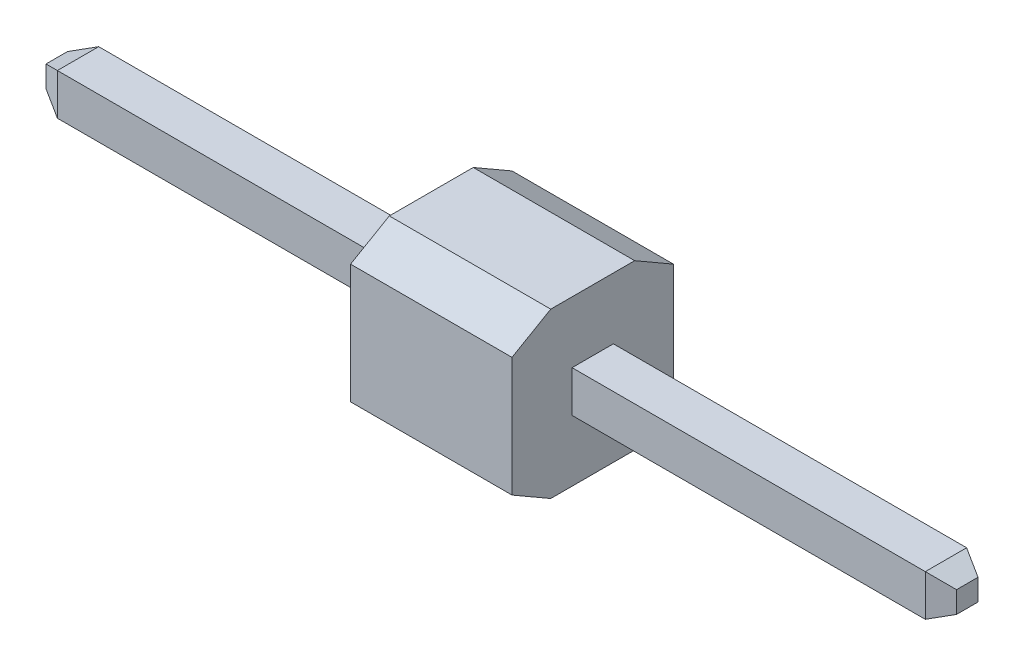
ISO-10303-21;
HEADER;
FILE_DESCRIPTION(('STEP AP214'),'2;1');
FILE_NAME('part.step','',(''),(''),'','','');
FILE_SCHEMA(('AUTOMOTIVE_DESIGN { 1 0 10303 214 1 1 1 1 }'));
ENDSEC;
DATA;
#1=APPLICATION_CONTEXT('core data for automotive mechanical design processes');
#2=APPLICATION_PROTOCOL_DEFINITION('international standard','automotive_design',2000,#1);
#3=PRODUCT_CONTEXT('',#1,'mechanical');
#4=PRODUCT('Part','Part','',(#3));
#5=PRODUCT_RELATED_PRODUCT_CATEGORY('part','',(#4));
#6=PRODUCT_DEFINITION_FORMATION('','',#4);
#7=PRODUCT_DEFINITION_CONTEXT('part definition',#1,'design');
#8=PRODUCT_DEFINITION('design','',#6,#7);
#9=PRODUCT_DEFINITION_SHAPE('','',#8);
#10=(LENGTH_UNIT() NAMED_UNIT(*) SI_UNIT(.MILLI.,.METRE.));
#11=(NAMED_UNIT(*) PLANE_ANGLE_UNIT() SI_UNIT($,.RADIAN.));
#12=(NAMED_UNIT(*) SI_UNIT($,.STERADIAN.) SOLID_ANGLE_UNIT());
#13=UNCERTAINTY_MEASURE_WITH_UNIT(LENGTH_MEASURE(1.E-05),#10,'distance_accuracy_value','');
#14=(GEOMETRIC_REPRESENTATION_CONTEXT(3) GLOBAL_UNCERTAINTY_ASSIGNED_CONTEXT((#13)) GLOBAL_UNIT_ASSIGNED_CONTEXT((#10,
#11,#12)) REPRESENTATION_CONTEXT('',''));
#15=CARTESIAN_POINT('',(0.,0.,0.));
#16=DIRECTION('',(0.,0.,1.));
#17=DIRECTION('',(1.,0.,0.));
#18=AXIS2_PLACEMENT_3D('',#15,#16,#17);
#19=CARTESIAN_POINT('',(5.42105003898686,2.22287173708609,0.629998634255617));
#20=DIRECTION('',(1.,4.37113882867379E-08,-4.37113882867379E-08));
#21=DIRECTION('',(-4.37113882867379E-08,1.,0.));
#22=AXIS2_PLACEMENT_3D('',#19,#20,#21);
#23=PLANE('',#22);
#24=DIRECTION('',(1.59994790123753E-08,0.500000000000193,0.866025403784327));
#25=VECTOR('',#24,1.);
#26=CARTESIAN_POINT('',(5.42104991600094,3.46646157557208,-0.940001365744382));
#27=LINE('',#26,#25);
#28=CARTESIAN_POINT('',(5.42104991600094,3.46646157557208,-0.940001365744382));
#29=VERTEX_POINT('',#28);
#30=CARTESIAN_POINT('',(5.4210499270857,3.81287173708609,-0.340001365744383));
#31=VERTEX_POINT('',#30);
#32=EDGE_CURVE('E11',#29,#31,#27,.T.);
#33=ORIENTED_EDGE('',*,*,#32,.T.);
#34=DIRECTION('',(4.37113880134522E-08,0.,0.999999999999999));
#35=VECTOR('',#34,1.);
#36=CARTESIAN_POINT('',(5.4210499270857,3.81287173708609,-0.340001365744383));
#37=LINE('',#36,#35);
#38=CARTESIAN_POINT('',(5.42104998391051,3.81287173708609,0.959998634255618));
#39=VERTEX_POINT('',#38);
#40=EDGE_CURVE('E304',#31,#39,#37,.T.);
#41=ORIENTED_EDGE('',*,*,#40,.T.);
#42=DIRECTION('',(5.97108668824037E-08,-0.500000000000186,0.866025403784329));
#43=VECTOR('',#42,1.);
#44=CARTESIAN_POINT('',(5.42104998391051,3.81287173708609,0.959998634255618));
#45=LINE('',#44,#43);
#46=CARTESIAN_POINT('',(5.42105002527941,3.46646157557209,1.55999863425562));
#47=VERTEX_POINT('',#46);
#48=EDGE_CURVE('E296',#39,#47,#45,.T.);
#49=ORIENTED_EDGE('',*,*,#48,.T.);
#50=DIRECTION('',(4.37113884816491E-08,-0.999999999999999,0.));
#51=VECTOR('',#50,1.);
#52=CARTESIAN_POINT('',(5.42105002527941,3.46646157557209,1.55999863425562));
#53=LINE('',#52,#51);
#54=CARTESIAN_POINT('',(5.4210501060222,1.61928189860609,1.55999863425562));
#55=VERTEX_POINT('',#54);
#56=EDGE_CURVE('E281',#47,#55,#53,.T.);
#57=ORIENTED_EDGE('',*,*,#56,.T.);
#58=DIRECTION('',(1.5999479012306E-08,0.500000000000192,0.866025403784328));
#59=VECTOR('',#58,1.);
#60=CARTESIAN_POINT('',(5.42105009493743,1.27287173708609,0.959998634255618));
#61=LINE('',#60,#59);
#62=CARTESIAN_POINT('',(5.42105009493743,1.27287173708609,0.959998634255618));
#63=VERTEX_POINT('',#62);
#64=EDGE_CURVE('E265',#63,#55,#61,.T.);
#65=ORIENTED_EDGE('',*,*,#64,.F.);
#66=DIRECTION('',(4.37113886966664E-08,0.,0.999999999999999));
#67=VECTOR('',#66,1.);
#68=CARTESIAN_POINT('',(5.42105003811263,1.27287173708609,-0.340001365744383));
#69=LINE('',#68,#67);
#70=CARTESIAN_POINT('',(5.42105003811263,1.27287173708609,-0.340001365744383));
#71=VERTEX_POINT('',#70);
#72=EDGE_CURVE('E248',#71,#63,#69,.T.);
#73=ORIENTED_EDGE('',*,*,#72,.F.);
#74=DIRECTION('',(5.971086560017E-08,-0.500000000000187,0.866025403784329));
#75=VECTOR('',#74,1.);
#76=CARTESIAN_POINT('',(5.42104999674373,1.61928189860608,-0.940001365744382));
#77=LINE('',#76,#75);
#78=CARTESIAN_POINT('',(5.42104999674373,1.61928189860608,-0.940001365744382));
#79=VERTEX_POINT('',#78);
#80=EDGE_CURVE('E242',#79,#71,#77,.T.);
#81=ORIENTED_EDGE('',*,*,#80,.F.);
#82=DIRECTION('',(4.37113884816491E-08,-0.999999999999999,0.));
#83=VECTOR('',#82,1.);
#84=CARTESIAN_POINT('',(5.42104991600094,3.46646157557208,-0.940001365744382));
#85=LINE('',#84,#83);
#86=EDGE_CURVE('E236',#29,#79,#85,.T.);
#87=ORIENTED_EDGE('',*,*,#86,.F.);
#88=EDGE_LOOP('',(#33,#41,#49,#57,#65,#73,#81,#87));
#89=FACE_BOUND('',#88,.T.);
#90=DIRECTION('',(-4.37113886753159E-08,0.,-0.999999999999999));
#91=VECTOR('',#90,1.);
#92=CARTESIAN_POINT('',(5.42105001101157,2.86287173708609,0.629998634255617));
#93=LINE('',#92,#91);
#94=CARTESIAN_POINT('',(5.42105001101157,2.86287173708609,0.629998634255617));
#95=VERTEX_POINT('',#94);
#96=CARTESIAN_POINT('',(5.42104998303628,2.86287173708609,-0.0100013657443826));
#97=VERTEX_POINT('',#96);
#98=EDGE_CURVE('E302',#95,#97,#93,.T.);
#99=ORIENTED_EDGE('',*,*,#98,.T.);
#100=DIRECTION('',(-4.37113886753159E-08,0.999999999999999,0.));
#101=VECTOR('',#100,1.);
#102=CARTESIAN_POINT('',(5.42105001101157,2.22287173708609,-0.0100013657443826));
#103=LINE('',#102,#101);
#104=CARTESIAN_POINT('',(5.42105001101157,2.22287173708609,-0.0100013657443826));
#105=VERTEX_POINT('',#104);
#106=EDGE_CURVE('E293',#105,#97,#103,.T.);
#107=ORIENTED_EDGE('',*,*,#106,.F.);
#108=DIRECTION('',(-4.37113886753159E-08,0.,-0.999999999999999));
#109=VECTOR('',#108,1.);
#110=CARTESIAN_POINT('',(5.42105003898686,2.22287173708609,0.629998634255617));
#111=LINE('',#110,#109);
#112=CARTESIAN_POINT('',(5.42105003898686,2.22287173708609,0.629998634255617));
#113=VERTEX_POINT('',#112);
#114=EDGE_CURVE('E278',#113,#105,#111,.T.);
#115=ORIENTED_EDGE('',*,*,#114,.F.);
#116=DIRECTION('',(-4.37113886753159E-08,0.999999999999999,0.));
#117=VECTOR('',#116,1.);
#118=CARTESIAN_POINT('',(5.42105003898686,2.22287173708609,0.629998634255617));
#119=LINE('',#118,#117);
#120=EDGE_CURVE('E263',#113,#95,#119,.T.);
#121=ORIENTED_EDGE('',*,*,#120,.T.);
#122=EDGE_LOOP('',(#99,#107,#115,#121));
#123=FACE_BOUND('',#122,.T.);
#124=ADVANCED_FACE('F17',(#89,#123),#23,.T.);
#125=CARTESIAN_POINT('',(2.92105003898686,2.22287162780762,0.629998743534088));
#126=DIRECTION('',(1.,4.37113882867379E-08,-4.37113882867379E-08));
#127=DIRECTION('',(-4.37113882867379E-08,1.,0.));
#128=AXIS2_PLACEMENT_3D('',#125,#126,#127);
#129=PLANE('',#128);
#130=DIRECTION('',(1.59994790123753E-08,0.500000000000193,0.866025403784327));
#131=VECTOR('',#130,1.);
#132=CARTESIAN_POINT('',(2.92104991600094,3.46646146629361,-0.940001256465912));
#133=LINE('',#132,#131);
#134=CARTESIAN_POINT('',(2.92104991600094,3.46646146629361,-0.940001256465912));
#135=VERTEX_POINT('',#134);
#136=CARTESIAN_POINT('',(2.9210499270857,3.81287162780762,-0.340001256465912));
#137=VERTEX_POINT('',#136);
#138=EDGE_CURVE('E24',#135,#137,#133,.T.);
#139=ORIENTED_EDGE('',*,*,#138,.F.);
#140=DIRECTION('',(4.37113884816491E-08,-0.999999999999999,0.));
#141=VECTOR('',#140,1.);
#142=CARTESIAN_POINT('',(2.92104991600094,3.46646146629361,-0.940001256465912));
#143=LINE('',#142,#141);
#144=CARTESIAN_POINT('',(2.92104999674373,1.61928178932761,-0.940001256465912));
#145=VERTEX_POINT('',#144);
#146=EDGE_CURVE('E300',#135,#145,#143,.T.);
#147=ORIENTED_EDGE('',*,*,#146,.T.);
#148=DIRECTION('',(5.97108662411576E-08,-0.500000000000187,0.866025403784329));
#149=VECTOR('',#148,1.);
#150=CARTESIAN_POINT('',(2.92104999674373,1.61928178932761,-0.940001256465912));
#151=LINE('',#150,#149);
#152=CARTESIAN_POINT('',(2.92105003811263,1.27287162780762,-0.340001256465912));
#153=VERTEX_POINT('',#152);
#154=EDGE_CURVE('E286',#145,#153,#151,.T.);
#155=ORIENTED_EDGE('',*,*,#154,.T.);
#156=DIRECTION('',(4.37113883550593E-08,0.,0.999999999999999));
#157=VECTOR('',#156,1.);
#158=CARTESIAN_POINT('',(2.92105003811263,1.27287162780762,-0.340001256465912));
#159=LINE('',#158,#157);
#160=CARTESIAN_POINT('',(2.92105009493743,1.27287162780762,0.959998743534088));
#161=VERTEX_POINT('',#160);
#162=EDGE_CURVE('E271',#153,#161,#159,.T.);
#163=ORIENTED_EDGE('',*,*,#162,.T.);
#164=DIRECTION('',(1.5999479012306E-08,0.500000000000192,0.866025403784328));
#165=VECTOR('',#164,1.);
#166=CARTESIAN_POINT('',(2.92105009493743,1.27287162780762,0.959998743534088));
#167=LINE('',#166,#165);
#168=CARTESIAN_POINT('',(2.9210501060222,1.61928178932762,1.55999874353409));
#169=VERTEX_POINT('',#168);
#170=EDGE_CURVE('E253',#161,#169,#167,.T.);
#171=ORIENTED_EDGE('',*,*,#170,.T.);
#172=DIRECTION('',(4.37113884816491E-08,-0.999999999999999,0.));
#173=VECTOR('',#172,1.);
#174=CARTESIAN_POINT('',(2.92105002527941,3.46646146629362,1.55999874353409));
#175=LINE('',#174,#173);
#176=CARTESIAN_POINT('',(2.92105002527941,3.46646146629362,1.55999874353409));
#177=VERTEX_POINT('',#176);
#178=EDGE_CURVE('E261',#177,#169,#175,.T.);
#179=ORIENTED_EDGE('',*,*,#178,.F.);
#180=DIRECTION('',(5.97108668824037E-08,-0.500000000000186,0.866025403784329));
#181=VECTOR('',#180,1.);
#182=CARTESIAN_POINT('',(2.92104998391051,3.81287162780762,0.959998743534088));
#183=LINE('',#182,#181);
#184=CARTESIAN_POINT('',(2.92104998391051,3.81287162780762,0.959998743534088));
#185=VERTEX_POINT('',#184);
#186=EDGE_CURVE('E276',#185,#177,#183,.T.);
#187=ORIENTED_EDGE('',*,*,#186,.F.);
#188=DIRECTION('',(4.37113880134522E-08,0.,0.999999999999999));
#189=VECTOR('',#188,1.);
#190=CARTESIAN_POINT('',(2.9210499270857,3.81287162780762,-0.340001256465912));
#191=LINE('',#190,#189);
#192=EDGE_CURVE('E291',#137,#185,#191,.T.);
#193=ORIENTED_EDGE('',*,*,#192,.F.);
#194=EDGE_LOOP('',(#139,#147,#155,#163,#171,#179,#187,#193));
#195=FACE_BOUND('',#194,.T.);
#196=DIRECTION('',(-4.37113886753159E-08,0.999999999999999,0.));
#197=VECTOR('',#196,1.);
#198=CARTESIAN_POINT('',(2.92105001101157,2.22287162780762,-0.0100012564659119));
#199=LINE('',#198,#197);
#200=CARTESIAN_POINT('',(2.92105001101157,2.22287162780762,-0.0100012564659119));
#201=VERTEX_POINT('',#200);
#202=CARTESIAN_POINT('',(2.92104998303628,2.86287162780762,-0.0100012564659119));
#203=VERTEX_POINT('',#202);
#204=EDGE_CURVE('E298',#201,#203,#199,.T.);
#205=ORIENTED_EDGE('',*,*,#204,.T.);
#206=DIRECTION('',(-4.37113886753159E-08,0.,-0.999999999999999));
#207=VECTOR('',#206,1.);
#208=CARTESIAN_POINT('',(2.92105001101157,2.86287162780762,0.629998743534088));
#209=LINE('',#208,#207);
#210=CARTESIAN_POINT('',(2.92105001101157,2.86287162780762,0.629998743534088));
#211=VERTEX_POINT('',#210);
#212=EDGE_CURVE('E283',#211,#203,#209,.T.);
#213=ORIENTED_EDGE('',*,*,#212,.F.);
#214=DIRECTION('',(-4.37113879814265E-08,0.999999999999999,0.));
#215=VECTOR('',#214,1.);
#216=CARTESIAN_POINT('',(2.92105003898686,2.22287162780762,0.629998743534088));
#217=LINE('',#216,#215);
#218=CARTESIAN_POINT('',(2.92105003898686,2.22287162780762,0.629998743534088));
#219=VERTEX_POINT('',#218);
#220=EDGE_CURVE('E268',#219,#211,#217,.T.);
#221=ORIENTED_EDGE('',*,*,#220,.F.);
#222=DIRECTION('',(-4.37113879814266E-08,0.,-0.999999999999999));
#223=VECTOR('',#222,1.);
#224=CARTESIAN_POINT('',(2.92105003898686,2.22287162780762,0.629998743534088));
#225=LINE('',#224,#223);
#226=EDGE_CURVE('E251',#219,#201,#225,.T.);
#227=ORIENTED_EDGE('',*,*,#226,.T.);
#228=EDGE_LOOP('',(#205,#213,#221,#227));
#229=FACE_BOUND('',#228,.T.);
#230=ADVANCED_FACE('F314',(#195,#229),#129,.F.);
#231=CARTESIAN_POINT('',(5.42104991600094,3.46646157557208,-0.940001365744382));
#232=DIRECTION('',(5.97108668343731E-08,-0.866025403784328,0.50000000000019));
#233=DIRECTION('',(-1.59994785476185E-08,-0.500000000000192,-0.866025403784329));
#234=AXIS2_PLACEMENT_3D('',#231,#232,#233);
#235=PLANE('',#234);
#236=ORIENTED_EDGE('',*,*,#138,.T.);
#237=DIRECTION('',(-0.999999999999998,-4.37113882867378E-08,4.37113883755557E-08));
#238=VECTOR('',#237,1.);
#239=CARTESIAN_POINT('',(5.4210499270857,3.81287173708609,-0.340001365744383));
#240=LINE('',#239,#238);
#241=EDGE_CURVE('E288',#31,#137,#240,.T.);
#242=ORIENTED_EDGE('',*,*,#241,.F.);
#243=ORIENTED_EDGE('',*,*,#32,.F.);
#244=DIRECTION('',(-0.999999999999998,-4.37113889972806E-08,4.37113881091022E-08));
#245=VECTOR('',#244,1.);
#246=CARTESIAN_POINT('',(5.42104991600094,3.46646157557208,-0.940001365744382));
#247=LINE('',#246,#245);
#248=EDGE_CURVE('E256',#29,#135,#247,.T.);
#249=ORIENTED_EDGE('',*,*,#248,.T.);
#250=EDGE_LOOP('',(#236,#242,#243,#249));
#251=FACE_BOUND('',#250,.T.);
#252=ADVANCED_FACE('F306',(#251),#235,.F.);
#253=CARTESIAN_POINT('',(5.4210499270857,3.81287173708609,-0.340001365744383));
#254=DIRECTION('',(4.37113882867379E-08,-1.,0.));
#255=DIRECTION('',(1.,4.37113882867379E-08,-4.37113882867379E-08));
#256=AXIS2_PLACEMENT_3D('',#253,#254,#255);
#257=PLANE('',#256);
#258=ORIENTED_EDGE('',*,*,#192,.T.);
#259=DIRECTION('',(-0.999999999999998,-4.37113882867378E-08,4.37113882867378E-08));
#260=VECTOR('',#259,1.);
#261=CARTESIAN_POINT('',(5.42104998391051,3.81287173708609,0.959998634255618));
#262=LINE('',#261,#260);
#263=EDGE_CURVE('E273',#39,#185,#262,.T.);
#264=ORIENTED_EDGE('',*,*,#263,.F.);
#265=ORIENTED_EDGE('',*,*,#40,.F.);
#266=ORIENTED_EDGE('',*,*,#241,.T.);
#267=EDGE_LOOP('',(#258,#264,#265,#266));
#268=FACE_BOUND('',#267,.T.);
#269=ADVANCED_FACE('F311',(#268),#257,.F.);
#270=CARTESIAN_POINT('',(5.42104998391051,3.81287173708609,0.959998634255618));
#271=DIRECTION('',(1.59994785476185E-08,-0.86602540378433,-0.50000000000019));
#272=DIRECTION('',(-5.97108668343731E-08,0.500000000000188,-0.866025403784329));
#273=AXIS2_PLACEMENT_3D('',#270,#271,#272);
#274=PLANE('',#273);
#275=ORIENTED_EDGE('',*,*,#186,.T.);
#276=DIRECTION('',(-0.999999999999998,-4.37113889972806E-08,4.37113882867378E-08));
#277=VECTOR('',#276,1.);
#278=CARTESIAN_POINT('',(5.42105002527941,3.46646157557209,1.55999863425562));
#279=LINE('',#278,#277);
#280=EDGE_CURVE('E258',#47,#177,#279,.T.);
#281=ORIENTED_EDGE('',*,*,#280,.F.);
#282=ORIENTED_EDGE('',*,*,#48,.F.);
#283=ORIENTED_EDGE('',*,*,#263,.T.);
#284=EDGE_LOOP('',(#275,#281,#282,#283));
#285=FACE_BOUND('',#284,.T.);
#286=ADVANCED_FACE('F319',(#285),#274,.F.);
#287=CARTESIAN_POINT('',(5.42105002527941,3.46646157557209,1.55999863425562));
#288=DIRECTION('',(-4.37113882867379E-08,0.,-1.));
#289=DIRECTION('',(-1.,-4.37113882867379E-08,4.37113882867379E-08));
#290=AXIS2_PLACEMENT_3D('',#287,#288,#289);
#291=PLANE('',#290);
#292=ORIENTED_EDGE('',*,*,#178,.T.);
#293=DIRECTION('',(-0.999999999999998,-4.37113889972806E-08,4.37113882867378E-08));
#294=VECTOR('',#293,1.);
#295=CARTESIAN_POINT('',(5.4210501060222,1.61928189860609,1.55999863425562));
#296=LINE('',#295,#294);
#297=EDGE_CURVE('E245',#55,#169,#296,.T.);
#298=ORIENTED_EDGE('',*,*,#297,.F.);
#299=ORIENTED_EDGE('',*,*,#56,.F.);
#300=ORIENTED_EDGE('',*,*,#280,.T.);
#301=EDGE_LOOP('',(#292,#298,#299,#300));
#302=FACE_BOUND('',#301,.T.);
#303=ADVANCED_FACE('F326',(#302),#291,.F.);
#304=CARTESIAN_POINT('',(5.42105009493743,1.27287173708609,0.959998634255618));
#305=DIRECTION('',(5.97108668343731E-08,-0.866025403784328,0.50000000000019));
#306=DIRECTION('',(-1.59994785476185E-08,-0.500000000000192,-0.866025403784329));
#307=AXIS2_PLACEMENT_3D('',#304,#305,#306);
#308=PLANE('',#307);
#309=ORIENTED_EDGE('',*,*,#170,.F.);
#310=DIRECTION('',(-0.999999999999998,-4.37113882867378E-08,4.37113882867378E-08));
#311=VECTOR('',#310,1.);
#312=CARTESIAN_POINT('',(5.42105009493743,1.27287173708609,0.959998634255618));
#313=LINE('',#312,#311);
#314=EDGE_CURVE('E239',#63,#161,#313,.T.);
#315=ORIENTED_EDGE('',*,*,#314,.F.);
#316=ORIENTED_EDGE('',*,*,#64,.T.);
#317=ORIENTED_EDGE('',*,*,#297,.T.);
#318=EDGE_LOOP('',(#309,#315,#316,#317));
#319=FACE_BOUND('',#318,.T.);
#320=ADVANCED_FACE('F329',(#319),#308,.T.);
#321=CARTESIAN_POINT('',(5.42105003811263,1.27287173708609,-0.340001365744383));
#322=DIRECTION('',(4.37113882867379E-08,-1.,0.));
#323=DIRECTION('',(1.,4.37113882867379E-08,-4.37113882867379E-08));
#324=AXIS2_PLACEMENT_3D('',#321,#322,#323);
#325=PLANE('',#324);
#326=ORIENTED_EDGE('',*,*,#162,.F.);
#327=DIRECTION('',(-0.999999999999998,-4.37113882867378E-08,4.37113883755557E-08));
#328=VECTOR('',#327,1.);
#329=CARTESIAN_POINT('',(5.42105003811263,1.27287173708609,-0.340001365744383));
#330=LINE('',#329,#328);
#331=EDGE_CURVE('E233',#71,#153,#330,.T.);
#332=ORIENTED_EDGE('',*,*,#331,.F.);
#333=ORIENTED_EDGE('',*,*,#72,.T.);
#334=ORIENTED_EDGE('',*,*,#314,.T.);
#335=EDGE_LOOP('',(#326,#332,#333,#334));
#336=FACE_BOUND('',#335,.T.);
#337=ADVANCED_FACE('F333',(#336),#325,.T.);
#338=CARTESIAN_POINT('',(5.42104999674373,1.61928189860608,-0.940001365744382));
#339=DIRECTION('',(1.59994785476185E-08,-0.86602540378433,-0.50000000000019));
#340=DIRECTION('',(-5.97108668343731E-08,0.500000000000188,-0.866025403784329));
#341=AXIS2_PLACEMENT_3D('',#338,#339,#340);
#342=PLANE('',#341);
#343=ORIENTED_EDGE('',*,*,#154,.F.);
#344=DIRECTION('',(-0.999999999999998,-4.37113889972806E-08,4.37113881091022E-08));
#345=VECTOR('',#344,1.);
#346=CARTESIAN_POINT('',(5.42104999674373,1.61928189860608,-0.940001365744382));
#347=LINE('',#346,#345);
#348=EDGE_CURVE('E230',#79,#145,#347,.T.);
#349=ORIENTED_EDGE('',*,*,#348,.F.);
#350=ORIENTED_EDGE('',*,*,#80,.T.);
#351=ORIENTED_EDGE('',*,*,#331,.T.);
#352=EDGE_LOOP('',(#343,#349,#350,#351));
#353=FACE_BOUND('',#352,.T.);
#354=ADVANCED_FACE('F337',(#353),#342,.T.);
#355=CARTESIAN_POINT('',(5.42104991600094,3.46646157557208,-0.940001365744382));
#356=DIRECTION('',(-4.37113882867379E-08,0.,-1.));
#357=DIRECTION('',(-4.37113882867379E-08,1.,0.));
#358=AXIS2_PLACEMENT_3D('',#355,#356,#357);
#359=PLANE('',#358);
#360=ORIENTED_EDGE('',*,*,#146,.F.);
#361=ORIENTED_EDGE('',*,*,#248,.F.);
#362=ORIENTED_EDGE('',*,*,#86,.T.);
#363=ORIENTED_EDGE('',*,*,#348,.T.);
#364=EDGE_LOOP('',(#360,#361,#362,#363));
#365=FACE_BOUND('',#364,.T.);
#366=ADVANCED_FACE('F339',(#365),#359,.T.);
#367=CARTESIAN_POINT('',(-2.87894996101314,2.22287137428157,0.62999899706014));
#368=DIRECTION('',(-1.,-4.37113882867379E-08,4.37113882867379E-08));
#369=DIRECTION('',(4.37113882867379E-08,-1.,0.));
#370=AXIS2_PLACEMENT_3D('',#367,#368,#369);
#371=PLANE('',#370);
#372=DIRECTION('',(4.37113847292273E-08,-0.999999999999999,0.));
#373=VECTOR('',#372,1.);
#374=CARTESIAN_POINT('',(-2.87895000351097,2.70898984709056,0.14388052425114));
#375=LINE('',#374,#373);
#376=CARTESIAN_POINT('',(-2.87895000351097,2.70898984709056,0.14388052425114));
#377=VERTEX_POINT('',#376);
#378=CARTESIAN_POINT('',(-2.87894998898843,2.37675290148156,0.14388052425114));
#379=VERTEX_POINT('',#378);
#380=EDGE_CURVE('E228',#377,#379,#375,.T.);
#381=ORIENTED_EDGE('',*,*,#380,.T.);
#382=DIRECTION('',(4.37113874013716E-08,0.,0.999999999999999));
#383=VECTOR('',#382,1.);
#384=CARTESIAN_POINT('',(-2.87894998898843,2.37675290148156,0.14388052425114));
#385=LINE('',#384,#383);
#386=CARTESIAN_POINT('',(-2.8789499744659,2.37675290148156,0.47611746986914));
#387=VERTEX_POINT('',#386);
#388=EDGE_CURVE('E223',#379,#387,#385,.T.);
#389=ORIENTED_EDGE('',*,*,#388,.T.);
#390=DIRECTION('',(-4.37113900758839E-08,0.999999999999999,0.));
#391=VECTOR('',#390,1.);
#392=CARTESIAN_POINT('',(-2.87894997446589,2.37675290148156,0.47611746986914));
#393=LINE('',#392,#391);
#394=CARTESIAN_POINT('',(-2.87894998898843,2.70898984709057,0.47611746986914));
#395=VERTEX_POINT('',#394);
#396=EDGE_CURVE('E215',#387,#395,#393,.T.);
#397=ORIENTED_EDGE('',*,*,#396,.T.);
#398=DIRECTION('',(-4.37113820547151E-08,0.,-0.999999999999999));
#399=VECTOR('',#398,1.);
#400=CARTESIAN_POINT('',(-2.87894998898843,2.70898984709057,0.47611746986914));
#401=LINE('',#400,#399);
#402=EDGE_CURVE('E207',#395,#377,#401,.T.);
#403=ORIENTED_EDGE('',*,*,#402,.T.);
#404=EDGE_LOOP('',(#381,#389,#397,#403));
#405=FACE_BOUND('',#404,.T.);
#406=ADVANCED_FACE('F341',(#405),#371,.T.);
#407=CARTESIAN_POINT('',(-2.87894996101314,2.22287137428157,0.62999899706014));
#408=DIRECTION('',(4.37113882867379E-08,-1.,0.));
#409=DIRECTION('',(-4.37113882867379E-08,0.,-1.));
#410=AXIS2_PLACEMENT_3D('',#407,#408,#409);
#411=PLANE('',#410);
#412=DIRECTION('',(0.999999999999998,4.37113888452998E-08,-4.37113882769955E-08));
#413=VECTOR('',#412,1.);
#414=CARTESIAN_POINT('',(-2.54894996101314,2.22287138870632,0.629998982635382));
#415=LINE('',#414,#413);
#416=CARTESIAN_POINT('',(-2.54894996101314,2.22287138870632,0.629998982635382));
#417=VERTEX_POINT('',#416);
#418=EDGE_CURVE('E225',#417,#219,#415,.T.);
#419=ORIENTED_EDGE('',*,*,#418,.F.);
#420=DIRECTION('',(-4.37113886753159E-08,0.,-0.999999999999999));
#421=VECTOR('',#420,1.);
#422=CARTESIAN_POINT('',(-2.54894996101314,2.22287138870632,0.629998982635382));
#423=LINE('',#422,#421);
#424=CARTESIAN_POINT('',(-2.54894998898843,2.22287138870632,-0.010001017364618));
#425=VERTEX_POINT('',#424);
#426=EDGE_CURVE('E217',#417,#425,#423,.T.);
#427=ORIENTED_EDGE('',*,*,#426,.T.);
#428=DIRECTION('',(0.999999999999998,4.37113888452998E-08,-4.37113882161057E-08));
#429=VECTOR('',#428,1.);
#430=CARTESIAN_POINT('',(-2.54894998898843,2.22287138870632,-0.010001017364618));
#431=LINE('',#430,#429);
#432=EDGE_CURVE('E220',#425,#201,#431,.T.);
#433=ORIENTED_EDGE('',*,*,#432,.T.);
#434=ORIENTED_EDGE('',*,*,#226,.F.);
#435=EDGE_LOOP('',(#419,#427,#433,#434));
#436=FACE_BOUND('',#435,.T.);
#437=ADVANCED_FACE('F348',(#436),#411,.T.);
#438=CARTESIAN_POINT('',(-2.87894998898843,2.22287137428156,-0.0100010029398598));
#439=DIRECTION('',(-4.37113882867379E-08,0.,-1.));
#440=DIRECTION('',(-1.,-4.37113882867379E-08,4.37113882867379E-08));
#441=AXIS2_PLACEMENT_3D('',#438,#439,#440);
#442=PLANE('',#441);
#443=ORIENTED_EDGE('',*,*,#432,.F.);
#444=DIRECTION('',(-4.37113886753159E-08,0.999999999999999,0.));
#445=VECTOR('',#444,1.);
#446=CARTESIAN_POINT('',(-2.54894998898843,2.22287138870632,-0.010001017364618));
#447=LINE('',#446,#445);
#448=CARTESIAN_POINT('',(-2.54895001696372,2.86287138870632,-0.010001017364618));
#449=VERTEX_POINT('',#448);
#450=EDGE_CURVE('E209',#425,#449,#447,.T.);
#451=ORIENTED_EDGE('',*,*,#450,.T.);
#452=DIRECTION('',(0.999999999999998,4.37113888452998E-08,-4.37113882161057E-08));
#453=VECTOR('',#452,1.);
#454=CARTESIAN_POINT('',(-2.54895001696372,2.86287138870632,-0.010001017364618));
#455=LINE('',#454,#453);
#456=EDGE_CURVE('E212',#449,#203,#455,.T.);
#457=ORIENTED_EDGE('',*,*,#456,.T.);
#458=ORIENTED_EDGE('',*,*,#204,.F.);
#459=EDGE_LOOP('',(#443,#451,#457,#458));
#460=FACE_BOUND('',#459,.T.);
#461=ADVANCED_FACE('F424',(#460),#442,.T.);
#462=CARTESIAN_POINT('',(-2.87894998898843,2.86287137428157,0.62999899706014));
#463=DIRECTION('',(4.37113882867379E-08,-1.,0.));
#464=DIRECTION('',(-4.37113882867379E-08,0.,-1.));
#465=AXIS2_PLACEMENT_3D('',#462,#463,#464);
#466=PLANE('',#465);
#467=ORIENTED_EDGE('',*,*,#456,.F.);
#468=DIRECTION('',(4.37113900630947E-08,0.,0.999999999999999));
#469=VECTOR('',#468,1.);
#470=CARTESIAN_POINT('',(-2.54895001696372,2.86287138870632,-0.010001017364618));
#471=LINE('',#470,#469);
#472=CARTESIAN_POINT('',(-2.54894998898843,2.86287138870632,0.629998982635382));
#473=VERTEX_POINT('',#472);
#474=EDGE_CURVE('E201',#449,#473,#471,.T.);
#475=ORIENTED_EDGE('',*,*,#474,.T.);
#476=DIRECTION('',(0.999999999999998,4.37113888452998E-08,-4.37113882769955E-08));
#477=VECTOR('',#476,1.);
#478=CARTESIAN_POINT('',(-2.54894998898843,2.86287138870632,0.629998982635382));
#479=LINE('',#478,#477);
#480=EDGE_CURVE('E204',#473,#211,#479,.T.);
#481=ORIENTED_EDGE('',*,*,#480,.T.);
#482=ORIENTED_EDGE('',*,*,#212,.T.);
#483=EDGE_LOOP('',(#467,#475,#481,#482));
#484=FACE_BOUND('',#483,.T.);
#485=ADVANCED_FACE('F421',(#484),#466,.F.);
#486=CARTESIAN_POINT('',(-2.87894996101314,2.22287137428157,0.62999899706014));
#487=DIRECTION('',(-4.37113882867379E-08,0.,-1.));
#488=DIRECTION('',(-1.,-4.37113882867379E-08,4.37113882867379E-08));
#489=AXIS2_PLACEMENT_3D('',#486,#487,#488);
#490=PLANE('',#489);
#491=ORIENTED_EDGE('',*,*,#480,.F.);
#492=DIRECTION('',(4.37113872875371E-08,-0.999999999999999,0.));
#493=VECTOR('',#492,1.);
#494=CARTESIAN_POINT('',(-2.54894998898843,2.86287138870632,0.629998982635382));
#495=LINE('',#494,#493);
#496=EDGE_CURVE('E196',#473,#417,#495,.T.);
#497=ORIENTED_EDGE('',*,*,#496,.T.);
#498=ORIENTED_EDGE('',*,*,#418,.T.);
#499=ORIENTED_EDGE('',*,*,#220,.T.);
#500=EDGE_LOOP('',(#491,#497,#498,#499));
#501=FACE_BOUND('',#500,.T.);
#502=ADVANCED_FACE('F376',(#501),#490,.F.);
#503=CARTESIAN_POINT('',(-2.87894996101314,2.22287137428157,0.62999899706014));
#504=DIRECTION('',(-4.37113882867379E-08,0.,-1.));
#505=DIRECTION('',(-1.,-4.37113882867379E-08,4.37113882867379E-08));
#506=AXIS2_PLACEMENT_3D('',#503,#504,#505);
#507=PLANE('',#506);
#508=DIRECTION('',(0.999999999999998,4.37113881958092E-08,-4.37113882769955E-08));
#509=VECTOR('',#508,1.);
#510=CARTESIAN_POINT('',(5.42105003898686,2.22287173708609,0.629998634255617));
#511=LINE('',#510,#509);
#512=CARTESIAN_POINT('',(10.8910500389869,2.22287197618738,0.629998395154324));
#513=VERTEX_POINT('',#512);
#514=EDGE_CURVE('E199',#113,#513,#511,.T.);
#515=ORIENTED_EDGE('',*,*,#514,.T.);
#516=DIRECTION('',(-4.37113900630947E-08,0.999999999999999,0.));
#517=VECTOR('',#516,1.);
#518=CARTESIAN_POINT('',(10.8910500389869,2.22287197618738,0.629998395154324));
#519=LINE('',#518,#517);
#520=CARTESIAN_POINT('',(10.8910500110116,2.86287197618738,0.629998395154324));
#521=VERTEX_POINT('',#520);
#522=EDGE_CURVE('E191',#513,#521,#519,.T.);
#523=ORIENTED_EDGE('',*,*,#522,.T.);
#524=DIRECTION('',(0.999999999999998,4.37113881958092E-08,-4.37113882769955E-08));
#525=VECTOR('',#524,1.);
#526=CARTESIAN_POINT('',(5.42105001101157,2.86287173708609,0.629998634255617));
#527=LINE('',#526,#525);
#528=EDGE_CURVE('E194',#95,#521,#527,.T.);
#529=ORIENTED_EDGE('',*,*,#528,.F.);
#530=ORIENTED_EDGE('',*,*,#120,.F.);
#531=EDGE_LOOP('',(#515,#523,#529,#530));
#532=FACE_BOUND('',#531,.T.);
#533=ADVANCED_FACE('F367',(#532),#507,.F.);
#534=CARTESIAN_POINT('',(-2.87894998898843,2.86287137428157,0.62999899706014));
#535=DIRECTION('',(4.37113882867379E-08,-1.,0.));
#536=DIRECTION('',(-4.37113882867379E-08,0.,-1.));
#537=AXIS2_PLACEMENT_3D('',#534,#535,#536);
#538=PLANE('',#537);
#539=ORIENTED_EDGE('',*,*,#528,.T.);
#540=DIRECTION('',(-4.37113900630947E-08,0.,-0.999999999999999));
#541=VECTOR('',#540,1.);
#542=CARTESIAN_POINT('',(10.8910500110116,2.86287197618738,0.629998395154324));
#543=LINE('',#542,#541);
#544=CARTESIAN_POINT('',(10.8910499830363,2.86287197618738,-0.0100016048456765));
#545=VERTEX_POINT('',#544);
#546=EDGE_CURVE('E186',#521,#545,#543,.T.);
#547=ORIENTED_EDGE('',*,*,#546,.T.);
#548=DIRECTION('',(0.999999999999998,4.37113881958092E-08,-4.37113881146228E-08));
#549=VECTOR('',#548,1.);
#550=CARTESIAN_POINT('',(5.42104998303628,2.86287173708609,-0.0100013657443823));
#551=LINE('',#550,#549);
#552=EDGE_CURVE('E189',#97,#545,#551,.T.);
#553=ORIENTED_EDGE('',*,*,#552,.F.);
#554=ORIENTED_EDGE('',*,*,#98,.F.);
#555=EDGE_LOOP('',(#539,#547,#553,#554));
#556=FACE_BOUND('',#555,.T.);
#557=ADVANCED_FACE('F364',(#556),#538,.F.);
#558=CARTESIAN_POINT('',(-2.87894998898843,2.22287137428156,-0.0100010029398598));
#559=DIRECTION('',(-4.37113882867379E-08,0.,-1.));
#560=DIRECTION('',(-1.,-4.37113882867379E-08,4.37113882867379E-08));
#561=AXIS2_PLACEMENT_3D('',#558,#559,#560);
#562=PLANE('',#561);
#563=ORIENTED_EDGE('',*,*,#552,.T.);
#564=DIRECTION('',(4.37113872875371E-08,-0.999999999999999,0.));
#565=VECTOR('',#564,1.);
#566=CARTESIAN_POINT('',(10.8910499830363,2.86287197618738,-0.0100016048456764));
#567=LINE('',#566,#565);
#568=CARTESIAN_POINT('',(10.8910500110116,2.22287197618738,-0.0100016048456765));
#569=VERTEX_POINT('',#568);
#570=EDGE_CURVE('E176',#545,#569,#567,.T.);
#571=ORIENTED_EDGE('',*,*,#570,.T.);
#572=DIRECTION('',(0.999999999999998,4.37113881958092E-08,-4.37113881146228E-08));
#573=VECTOR('',#572,1.);
#574=CARTESIAN_POINT('',(5.42105001101157,2.22287173708609,-0.0100013657443823));
#575=LINE('',#574,#573);
#576=EDGE_CURVE('E179',#105,#569,#575,.T.);
#577=ORIENTED_EDGE('',*,*,#576,.F.);
#578=ORIENTED_EDGE('',*,*,#106,.T.);
#579=EDGE_LOOP('',(#563,#571,#577,#578));
#580=FACE_BOUND('',#579,.T.);
#581=ADVANCED_FACE('F366',(#580),#562,.T.);
#582=CARTESIAN_POINT('',(-2.87894996101314,2.22287137428157,0.62999899706014));
#583=DIRECTION('',(4.37113882867379E-08,-1.,0.));
#584=DIRECTION('',(-4.37113882867379E-08,0.,-1.));
#585=AXIS2_PLACEMENT_3D('',#582,#583,#584);
#586=PLANE('',#585);
#587=ORIENTED_EDGE('',*,*,#576,.T.);
#588=DIRECTION('',(4.37113845119796E-08,0.,0.999999999999999));
#589=VECTOR('',#588,1.);
#590=CARTESIAN_POINT('',(10.8910500110116,2.22287197618738,-0.0100016048456765));
#591=LINE('',#590,#589);
#592=EDGE_CURVE('E167',#569,#513,#591,.T.);
#593=ORIENTED_EDGE('',*,*,#592,.T.);
#594=ORIENTED_EDGE('',*,*,#514,.F.);
#595=ORIENTED_EDGE('',*,*,#114,.T.);
#596=EDGE_LOOP('',(#587,#593,#594,#595));
#597=FACE_BOUND('',#596,.T.);
#598=ADVANCED_FACE('F373',(#597),#586,.T.);
#599=CARTESIAN_POINT('',(11.2210500389869,2.22287199061214,0.629998380729565));
#600=DIRECTION('',(-1.,-4.37113882867379E-08,4.37113882867379E-08));
#601=DIRECTION('',(4.37113882867379E-08,-1.,0.));
#602=AXIS2_PLACEMENT_3D('',#599,#600,#601);
#603=PLANE('',#602);
#604=DIRECTION('',(-4.37113874025556E-08,0.999999999999999,0.));
#605=VECTOR('',#604,1.);
#606=CARTESIAN_POINT('',(11.2210500110116,2.37675351781214,0.143879907920565));
#607=LINE('',#606,#605);
#608=CARTESIAN_POINT('',(11.2210500110116,2.37675351781214,0.143879907920565));
#609=VERTEX_POINT('',#608);
#610=CARTESIAN_POINT('',(11.221049996489,2.70899046342114,0.143879907920565));
#611=VERTEX_POINT('',#610);
#612=EDGE_CURVE('E153',#609,#611,#607,.T.);
#613=ORIENTED_EDGE('',*,*,#612,.T.);
#614=DIRECTION('',(4.37113874013716E-08,0.,0.999999999999999));
#615=VECTOR('',#614,1.);
#616=CARTESIAN_POINT('',(11.221049996489,2.70899046342114,0.143879907920565));
#617=LINE('',#616,#615);
#618=CARTESIAN_POINT('',(11.2210500110116,2.70899046342114,0.476116853538565));
#619=VERTEX_POINT('',#618);
#620=EDGE_CURVE('E395',#611,#619,#617,.T.);
#621=ORIENTED_EDGE('',*,*,#620,.T.);
#622=DIRECTION('',(4.37113927492122E-08,-0.999999999999999,0.));
#623=VECTOR('',#622,1.);
#624=CARTESIAN_POINT('',(11.2210500110116,2.70899046342114,0.476116853538565));
#625=LINE('',#624,#623);
#626=CARTESIAN_POINT('',(11.2210500255341,2.37675351781214,0.476116853538565));
#627=VERTEX_POINT('',#626);
#628=EDGE_CURVE('E156',#619,#627,#625,.T.);
#629=ORIENTED_EDGE('',*,*,#628,.T.);
#630=DIRECTION('',(-4.37113980946847E-08,0.,-0.999999999999999));
#631=VECTOR('',#630,1.);
#632=CARTESIAN_POINT('',(11.2210500255341,2.37675351781214,0.476116853538565));
#633=LINE('',#632,#631);
#634=EDGE_CURVE('E149',#627,#609,#633,.T.);
#635=ORIENTED_EDGE('',*,*,#634,.T.);
#636=EDGE_LOOP('',(#613,#621,#629,#635));
#637=FACE_BOUND('',#636,.T.);
#638=ADVANCED_FACE('F151',(#637),#603,.F.);
#639=CARTESIAN_POINT('',(-2.87894998226206,2.70898984709057,0.62999899706014));
#640=DIRECTION('',(-0.422618301356784,0.906307768563367,1.84732310895534E-08));
#641=DIRECTION('',(4.37113882867379E-08,0.,1.));
#642=AXIS2_PLACEMENT_3D('',#639,#640,#641);
#643=PLANE('',#642);
#644=DIRECTION('',(0.834817095446926,0.389281657126019,-0.389281657126018));
#645=VECTOR('',#644,1.);
#646=CARTESIAN_POINT('',(-2.87895000351066,2.70898984709023,0.143880524251471));
#647=LINE('',#646,#645);
#648=EDGE_CURVE('E181',#377,#449,#647,.T.);
#649=ORIENTED_EDGE('',*,*,#648,.F.);
#650=ORIENTED_EDGE('',*,*,#402,.F.);
#651=DIRECTION('',(-0.834817129479006,-0.38928165712602,-0.389281584143987));
#652=VECTOR('',#651,1.);
#653=CARTESIAN_POINT('',(-2.54894998898821,2.86287138870609,0.629998982635147));
#654=LINE('',#653,#652);
#655=EDGE_CURVE('E404',#473,#395,#654,.T.);
#656=ORIENTED_EDGE('',*,*,#655,.F.);
#657=ORIENTED_EDGE('',*,*,#474,.F.);
#658=EDGE_LOOP('',(#649,#650,#656,#657));
#659=FACE_BOUND('',#658,.T.);
#660=ADVANCED_FACE('F418',(#659),#643,.T.);
#661=CARTESIAN_POINT('',(-2.87894996773952,2.22287137428157,0.47611746986914));
#662=DIRECTION('',(-0.422618222124841,-1.84732292043498E-08,0.906307805509828));
#663=DIRECTION('',(4.37113882867379E-08,-1.,0.));
#664=AXIS2_PLACEMENT_3D('',#661,#662,#663);
#665=PLANE('',#664);
#666=ORIENTED_EDGE('',*,*,#655,.T.);
#667=ORIENTED_EDGE('',*,*,#396,.F.);
#668=DIRECTION('',(-0.834817163511088,0.389281584143984,-0.389281584143987));
#669=VECTOR('',#668,1.);
#670=CARTESIAN_POINT('',(-2.548949961012,2.22287138870905,0.629998982635654));
#671=LINE('',#670,#669);
#672=EDGE_CURVE('E160',#417,#387,#671,.T.);
#673=ORIENTED_EDGE('',*,*,#672,.F.);
#674=ORIENTED_EDGE('',*,*,#496,.F.);
#675=EDGE_LOOP('',(#666,#667,#673,#674));
#676=FACE_BOUND('',#675,.T.);
#677=ADVANCED_FACE('F434',(#676),#665,.T.);
#678=CARTESIAN_POINT('',(-2.54894998898843,2.22287138870632,-0.010001017364618));
#679=DIRECTION('',(0.422618301356784,1.8473232667688E-08,0.906307768563367));
#680=DIRECTION('',(-4.37113882867379E-08,1.,0.));
#681=AXIS2_PLACEMENT_3D('',#678,#679,#680);
#682=PLANE('',#681);
#683=ORIENTED_EDGE('',*,*,#648,.T.);
#684=ORIENTED_EDGE('',*,*,#450,.F.);
#685=DIRECTION('',(0.834817129479007,-0.389281584143989,-0.389281657126018));
#686=VECTOR('',#685,1.);
#687=CARTESIAN_POINT('',(-2.87894998899127,2.37675290147402,0.1438805242526));
#688=LINE('',#687,#686);
#689=EDGE_CURVE('E170',#379,#425,#688,.T.);
#690=ORIENTED_EDGE('',*,*,#689,.F.);
#691=ORIENTED_EDGE('',*,*,#380,.F.);
#692=EDGE_LOOP('',(#683,#684,#690,#691));
#693=FACE_BOUND('',#692,.T.);
#694=ADVANCED_FACE('F413',(#693),#682,.F.);
#695=CARTESIAN_POINT('',(-2.54894996101314,2.22287138870632,0.629998982635382));
#696=DIRECTION('',(0.422618222124841,0.906307805509828,-1.84732308250282E-08));
#697=DIRECTION('',(-4.37113882867379E-08,0.,-1.));
#698=AXIS2_PLACEMENT_3D('',#695,#696,#697);
#699=PLANE('',#698);
#700=ORIENTED_EDGE('',*,*,#672,.T.);
#701=ORIENTED_EDGE('',*,*,#388,.F.);
#702=ORIENTED_EDGE('',*,*,#689,.T.);
#703=ORIENTED_EDGE('',*,*,#426,.F.);
#704=EDGE_LOOP('',(#700,#701,#702,#703));
#705=FACE_BOUND('',#704,.T.);
#706=ADVANCED_FACE('F429',(#705),#699,.F.);
#707=CARTESIAN_POINT('',(11.2210500322605,2.37675351781214,0.629998380729565));
#708=DIRECTION('',(0.422618301356784,-0.906307768563367,-1.84732310470096E-08));
#709=DIRECTION('',(4.37113882867379E-08,0.,1.));
#710=AXIS2_PLACEMENT_3D('',#707,#708,#709);
#711=PLANE('',#710);
#712=DIRECTION('',(-0.834817129479004,-0.389281657126023,-0.389281584143989));
#713=VECTOR('',#712,1.);
#714=CARTESIAN_POINT('',(11.2210500110142,2.37675351780483,0.14387990792226));
#715=LINE('',#714,#713);
#716=EDGE_CURVE('E164',#609,#569,#715,.T.);
#717=ORIENTED_EDGE('',*,*,#716,.F.);
#718=ORIENTED_EDGE('',*,*,#634,.F.);
#719=DIRECTION('',(0.834817095446926,0.389281657126019,-0.389281657126017));
#720=VECTOR('',#719,1.);
#721=CARTESIAN_POINT('',(10.8910500389869,2.22287197618738,0.629998395154324));
#722=LINE('',#721,#720);
#723=EDGE_CURVE('E392',#513,#627,#722,.T.);
#724=ORIENTED_EDGE('',*,*,#723,.F.);
#725=ORIENTED_EDGE('',*,*,#592,.F.);
#726=EDGE_LOOP('',(#717,#718,#724,#725));
#727=FACE_BOUND('',#726,.T.);
#728=ADVANCED_FACE('F165',(#727),#711,.T.);
#729=CARTESIAN_POINT('',(10.8910500389869,2.22287197618738,0.629998395154324));
#730=DIRECTION('',(-0.422618301356784,-1.8473232667688E-08,-0.906307768563367));
#731=DIRECTION('',(-4.37113882867379E-08,1.,0.));
#732=AXIS2_PLACEMENT_3D('',#729,#730,#731);
#733=PLANE('',#732);
#734=ORIENTED_EDGE('',*,*,#723,.T.);
#735=ORIENTED_EDGE('',*,*,#628,.F.);
#736=DIRECTION('',(0.834817129479005,-0.389281584143989,-0.389281657126021));
#737=VECTOR('',#736,1.);
#738=CARTESIAN_POINT('',(10.8910500110115,2.86287197618735,0.629998395154179));
#739=LINE('',#738,#737);
#740=EDGE_CURVE('E389',#521,#619,#739,.T.);
#741=ORIENTED_EDGE('',*,*,#740,.F.);
#742=ORIENTED_EDGE('',*,*,#522,.F.);
#743=EDGE_LOOP('',(#734,#735,#741,#742));
#744=FACE_BOUND('',#743,.T.);
#745=ADVANCED_FACE('F390',(#744),#733,.F.);
#746=CARTESIAN_POINT('',(11.2210500177379,2.22287199061214,0.143879907920565));
#747=DIRECTION('',(0.422618222124841,1.84732292043498E-08,-0.906307805509828));
#748=DIRECTION('',(4.37113882867379E-08,-1.,0.));
#749=AXIS2_PLACEMENT_3D('',#746,#747,#748);
#750=PLANE('',#749);
#751=ORIENTED_EDGE('',*,*,#716,.T.);
#752=ORIENTED_EDGE('',*,*,#570,.F.);
#753=DIRECTION('',(-0.834817163511087,0.389281584143986,-0.389281584143986));
#754=VECTOR('',#753,1.);
#755=CARTESIAN_POINT('',(11.2210499964887,2.70899046342081,0.143879907920897));
#756=LINE('',#755,#754);
#757=EDGE_CURVE('E175',#611,#545,#756,.T.);
#758=ORIENTED_EDGE('',*,*,#757,.F.);
#759=ORIENTED_EDGE('',*,*,#612,.F.);
#760=EDGE_LOOP('',(#751,#752,#758,#759));
#761=FACE_BOUND('',#760,.T.);
#762=ADVANCED_FACE('F173',(#761),#750,.T.);
#763=CARTESIAN_POINT('',(10.8910500110116,2.86287197618738,0.629998395154324));
#764=DIRECTION('',(-0.422618222124841,-0.906307805509828,1.84732307824844E-08));
#765=DIRECTION('',(-4.37113882867379E-08,0.,-1.));
#766=AXIS2_PLACEMENT_3D('',#763,#764,#765);
#767=PLANE('',#766);
#768=ORIENTED_EDGE('',*,*,#740,.T.);
#769=ORIENTED_EDGE('',*,*,#620,.F.);
#770=ORIENTED_EDGE('',*,*,#757,.T.);
#771=ORIENTED_EDGE('',*,*,#546,.F.);
#772=EDGE_LOOP('',(#768,#769,#770,#771));
#773=FACE_BOUND('',#772,.T.);
#774=ADVANCED_FACE('F394',(#773),#767,.F.);
#775=CLOSED_SHELL('',(#124,#230,#252,#269,#286,#303,#320,#337,#354,#366,#406,#437,#461,#485,
#502,#533,#557,#581,#598,#638,#660,#677,#694,#706,#728,#745,#762,#774));
#776=MANIFOLD_SOLID_BREP('B1',#775);
#777=ADVANCED_BREP_SHAPE_REPRESENTATION('',(#18,#776),#14);
#778=SHAPE_DEFINITION_REPRESENTATION(#9,#777);
ENDSEC;
END-ISO-10303-21;
